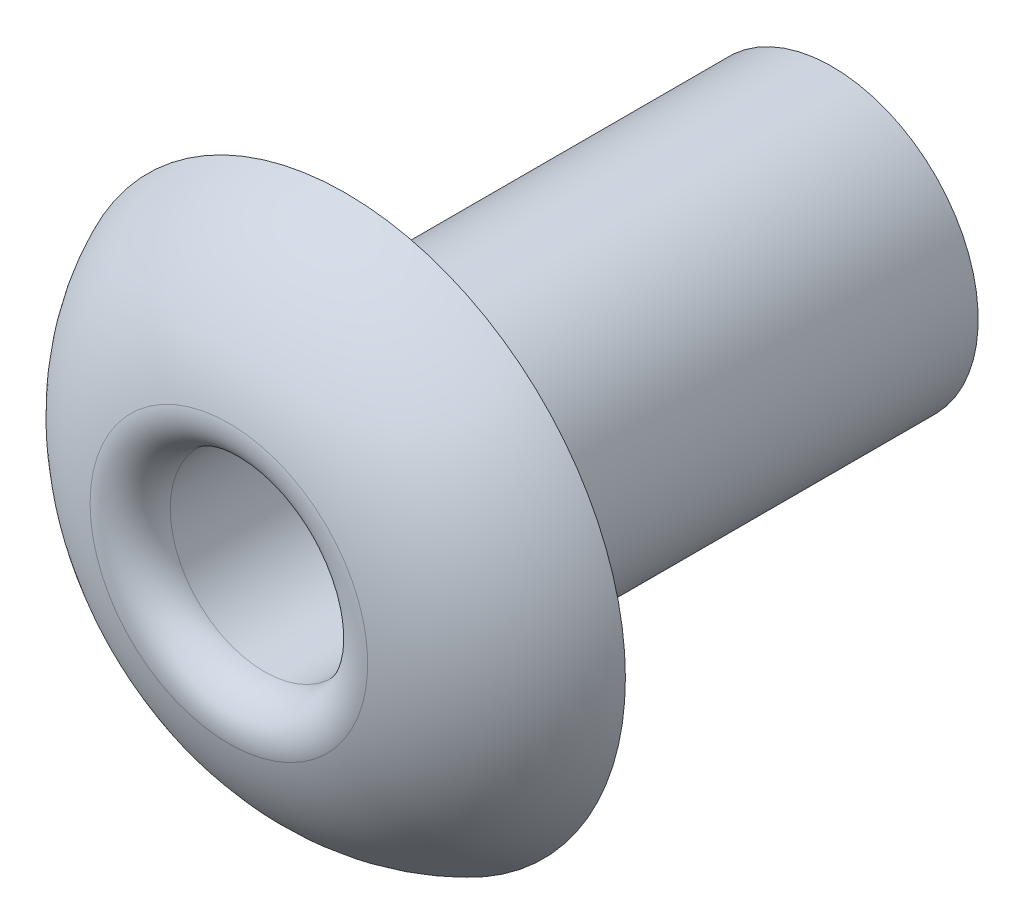
ISO-10303-21;
HEADER;
FILE_DESCRIPTION(('STEP AP214'),'2;1');
FILE_NAME('part.step','',(''),(''),'','','');
FILE_SCHEMA(('AUTOMOTIVE_DESIGN { 1 0 10303 214 1 1 1 1 }'));
ENDSEC;
DATA;
#1=APPLICATION_CONTEXT('core data for automotive mechanical design processes');
#2=APPLICATION_PROTOCOL_DEFINITION('international standard','automotive_design',2000,#1);
#3=PRODUCT_CONTEXT('',#1,'mechanical');
#4=PRODUCT('Part','Part','',(#3));
#5=PRODUCT_RELATED_PRODUCT_CATEGORY('part','',(#4));
#6=PRODUCT_DEFINITION_FORMATION('','',#4);
#7=PRODUCT_DEFINITION_CONTEXT('part definition',#1,'design');
#8=PRODUCT_DEFINITION('design','',#6,#7);
#9=PRODUCT_DEFINITION_SHAPE('','',#8);
#10=(LENGTH_UNIT() NAMED_UNIT(*) SI_UNIT(.MILLI.,.METRE.));
#11=(NAMED_UNIT(*) PLANE_ANGLE_UNIT() SI_UNIT($,.RADIAN.));
#12=(NAMED_UNIT(*) SI_UNIT($,.STERADIAN.) SOLID_ANGLE_UNIT());
#13=UNCERTAINTY_MEASURE_WITH_UNIT(LENGTH_MEASURE(1.E-05),#10,'distance_accuracy_value','');
#14=(GEOMETRIC_REPRESENTATION_CONTEXT(3) GLOBAL_UNCERTAINTY_ASSIGNED_CONTEXT((#13)) GLOBAL_UNIT_ASSIGNED_CONTEXT((#10,
#11,#12)) REPRESENTATION_CONTEXT('',''));
#15=CARTESIAN_POINT('',(0.,0.,0.));
#16=DIRECTION('',(0.,0.,1.));
#17=DIRECTION('',(1.,0.,0.));
#18=AXIS2_PLACEMENT_3D('',#15,#16,#17);
#19=CARTESIAN_POINT('',(0.,0.,-0.662812500000001));
#20=DIRECTION('',(0.,0.,-1.));
#21=DIRECTION('',(-1.,0.,0.));
#22=AXIS2_PLACEMENT_3D('',#19,#20,#21);
#23=DEGENERATE_TOROIDAL_SURFACE('',#22,0.775,1.6628125,.T.);
#24=CARTESIAN_POINT('',(0.,0.,0.959210990094682));
#25=DIRECTION('',(0.,0.,-1.));
#26=DIRECTION('',(-1.,0.,0.));
#27=AXIS2_PLACEMENT_3D('',#24,#25,#26);
#28=CIRCLE('',#27,1.14103989910571);
#29=CARTESIAN_POINT('',(-1.14103989910571,0.,0.959210990094682));
#30=VERTEX_POINT('',#29);
#31=EDGE_CURVE('E40',#30,#30,#28,.T.);
#32=ORIENTED_EDGE('',*,*,#31,.T.);
#33=EDGE_LOOP('',(#32));
#34=FACE_BOUND('',#33,.T.);
#35=CARTESIAN_POINT('',(0.,0.,0.));
#36=DIRECTION('',(0.,0.,-1.));
#37=DIRECTION('',(-1.,0.,0.));
#38=AXIS2_PLACEMENT_3D('',#35,#36,#37);
#39=CIRCLE('',#38,2.3);
#40=CARTESIAN_POINT('',(-2.3,0.,0.));
#41=VERTEX_POINT('',#40);
#42=EDGE_CURVE('E56',#41,#41,#39,.T.);
#43=ORIENTED_EDGE('',*,*,#42,.F.);
#44=EDGE_LOOP('',(#43));
#45=FACE_BOUND('',#44,.T.);
#46=ADVANCED_FACE('F33',(#34,#45),#23,.T.);
#47=CARTESIAN_POINT('',(0.,0.,-4.));
#48=DIRECTION('',(0.,0.,-1.));
#49=DIRECTION('',(-1.,0.,0.));
#50=AXIS2_PLACEMENT_3D('',#47,#48,#49);
#51=CYLINDRICAL_SURFACE('',#50,0.775);
#52=CARTESIAN_POINT('',(0.,0.,0.666570029656626));
#53=DIRECTION('',(0.,0.,1.));
#54=DIRECTION('',(1.,0.,0.));
#55=AXIS2_PLACEMENT_3D('',#52,#53,#54);
#56=CIRCLE('',#55,0.775);
#57=CARTESIAN_POINT('',(0.775,0.,0.666570029656626));
#58=VERTEX_POINT('',#57);
#59=EDGE_CURVE('E10',#58,#58,#56,.T.);
#60=ORIENTED_EDGE('',*,*,#59,.T.);
#61=EDGE_LOOP('',(#60));
#62=FACE_BOUND('',#61,.T.);
#63=CARTESIAN_POINT('',(0.,0.,-4.));
#64=DIRECTION('',(0.,0.,-1.));
#65=DIRECTION('',(-1.,0.,0.));
#66=AXIS2_PLACEMENT_3D('',#63,#64,#65);
#67=CIRCLE('',#66,0.775);
#68=CARTESIAN_POINT('',(-0.775,0.,-4.));
#69=VERTEX_POINT('',#68);
#70=EDGE_CURVE('E44',#69,#69,#67,.T.);
#71=ORIENTED_EDGE('',*,*,#70,.T.);
#72=EDGE_LOOP('',(#71));
#73=FACE_BOUND('',#72,.T.);
#74=ADVANCED_FACE('F64',(#62,#73),#51,.F.);
#75=CARTESIAN_POINT('',(0.,1.2,-4.));
#76=DIRECTION('',(0.,0.,-1.));
#77=DIRECTION('',(-1.,0.,0.));
#78=AXIS2_PLACEMENT_3D('',#75,#76,#77);
#79=PLANE('',#78);
#80=CARTESIAN_POINT('',(0.,0.,-4.));
#81=DIRECTION('',(0.,0.,-1.));
#82=DIRECTION('',(-1.,0.,0.));
#83=AXIS2_PLACEMENT_3D('',#80,#81,#82);
#84=CIRCLE('',#83,1.2);
#85=CARTESIAN_POINT('',(-1.2,0.,-4.));
#86=VERTEX_POINT('',#85);
#87=EDGE_CURVE('E48',#86,#86,#84,.T.);
#88=ORIENTED_EDGE('',*,*,#87,.T.);
#89=EDGE_LOOP('',(#88));
#90=FACE_BOUND('',#89,.T.);
#91=ORIENTED_EDGE('',*,*,#70,.F.);
#92=EDGE_LOOP('',(#91));
#93=FACE_BOUND('',#92,.T.);
#94=ADVANCED_FACE('F68',(#90,#93),#79,.T.);
#95=CARTESIAN_POINT('',(0.,0.,-4.));
#96=DIRECTION('',(0.,0.,-1.));
#97=DIRECTION('',(-1.,0.,0.));
#98=AXIS2_PLACEMENT_3D('',#95,#96,#97);
#99=CYLINDRICAL_SURFACE('',#98,1.2);
#100=CARTESIAN_POINT('',(0.,0.,0.));
#101=DIRECTION('',(0.,0.,-1.));
#102=DIRECTION('',(-1.,0.,0.));
#103=AXIS2_PLACEMENT_3D('',#100,#101,#102);
#104=CIRCLE('',#103,1.2);
#105=CARTESIAN_POINT('',(-1.2,0.,0.));
#106=VERTEX_POINT('',#105);
#107=EDGE_CURVE('E53',#106,#106,#104,.T.);
#108=ORIENTED_EDGE('',*,*,#107,.T.);
#109=EDGE_LOOP('',(#108));
#110=FACE_BOUND('',#109,.T.);
#111=ORIENTED_EDGE('',*,*,#87,.F.);
#112=EDGE_LOOP('',(#111));
#113=FACE_BOUND('',#112,.T.);
#114=ADVANCED_FACE('F73',(#110,#113),#99,.T.);
#115=CARTESIAN_POINT('',(0.,1.2,0.));
#116=DIRECTION('',(0.,0.,-1.));
#117=DIRECTION('',(-1.,0.,0.));
#118=AXIS2_PLACEMENT_3D('',#115,#116,#117);
#119=PLANE('',#118);
#120=ORIENTED_EDGE('',*,*,#42,.T.);
#121=EDGE_LOOP('',(#120));
#122=FACE_BOUND('',#121,.T.);
#123=ORIENTED_EDGE('',*,*,#107,.F.);
#124=EDGE_LOOP('',(#123));
#125=FACE_BOUND('',#124,.T.);
#126=ADVANCED_FACE('F60',(#122,#125),#119,.T.);
#127=CARTESIAN_POINT('',(0.,0.,0.666570029656626));
#128=DIRECTION('',(0.,0.,1.));
#129=DIRECTION('',(1.,0.,0.));
#130=AXIS2_PLACEMENT_3D('',#127,#128,#129);
#131=TOROIDAL_SURFACE('',#130,1.075,0.3);
#132=ORIENTED_EDGE('',*,*,#59,.F.);
#133=EDGE_LOOP('',(#132));
#134=FACE_BOUND('',#133,.T.);
#135=ORIENTED_EDGE('',*,*,#31,.F.);
#136=EDGE_LOOP('',(#135));
#137=FACE_BOUND('',#136,.T.);
#138=ADVANCED_FACE('F35',(#134,#137),#131,.T.);
#139=CLOSED_SHELL('',(#46,#74,#94,#114,#126,#138));
#140=MANIFOLD_SOLID_BREP('B2',#139);
#141=ADVANCED_BREP_SHAPE_REPRESENTATION('',(#18,#140),#14);
#142=SHAPE_DEFINITION_REPRESENTATION(#9,#141);
ENDSEC;
END-ISO-10303-21;
